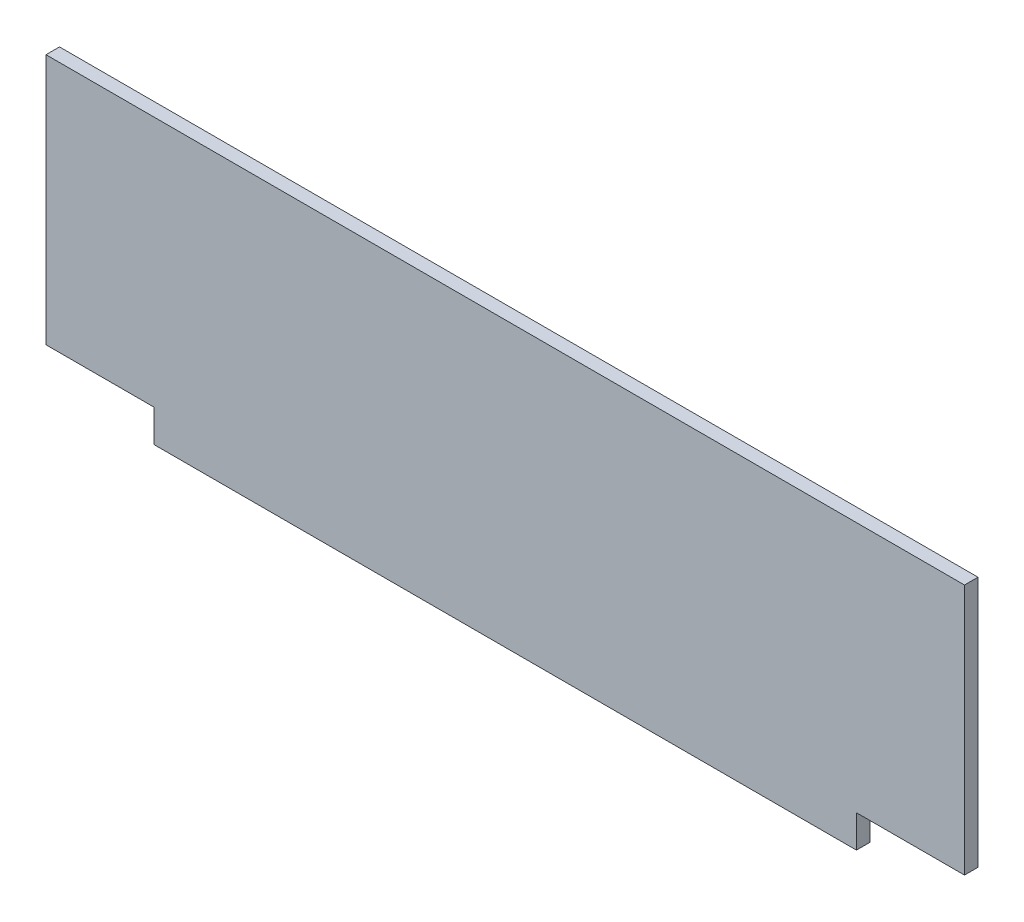
ISO-10303-21;
HEADER;
FILE_DESCRIPTION(('STEP AP214'),'2;1');
FILE_NAME('part.step','',(''),(''),'','','');
FILE_SCHEMA(('AUTOMOTIVE_DESIGN { 1 0 10303 214 1 1 1 1 }'));
ENDSEC;
DATA;
#1=APPLICATION_CONTEXT('core data for automotive mechanical design processes');
#2=APPLICATION_PROTOCOL_DEFINITION('international standard','automotive_design',2000,#1);
#3=PRODUCT_CONTEXT('',#1,'mechanical');
#4=PRODUCT('Part','Part','',(#3));
#5=PRODUCT_RELATED_PRODUCT_CATEGORY('part','',(#4));
#6=PRODUCT_DEFINITION_FORMATION('','',#4);
#7=PRODUCT_DEFINITION_CONTEXT('part definition',#1,'design');
#8=PRODUCT_DEFINITION('design','',#6,#7);
#9=PRODUCT_DEFINITION_SHAPE('','',#8);
#10=(LENGTH_UNIT() NAMED_UNIT(*) SI_UNIT(.MILLI.,.METRE.));
#11=(NAMED_UNIT(*) PLANE_ANGLE_UNIT() SI_UNIT($,.RADIAN.));
#12=(NAMED_UNIT(*) SI_UNIT($,.STERADIAN.) SOLID_ANGLE_UNIT());
#13=UNCERTAINTY_MEASURE_WITH_UNIT(LENGTH_MEASURE(1.E-05),#10,'distance_accuracy_value','');
#14=(GEOMETRIC_REPRESENTATION_CONTEXT(3) GLOBAL_UNCERTAINTY_ASSIGNED_CONTEXT((#13)) GLOBAL_UNIT_ASSIGNED_CONTEXT((#10,
#11,#12)) REPRESENTATION_CONTEXT('',''));
#15=CARTESIAN_POINT('',(0.,0.,0.));
#16=DIRECTION('',(0.,0.,1.));
#17=DIRECTION('',(1.,0.,0.));
#18=AXIS2_PLACEMENT_3D('',#15,#16,#17);
#19=CARTESIAN_POINT('',(-340.,105.,10.));
#20=DIRECTION('',(1.,0.,0.));
#21=DIRECTION('',(0.,0.,-1.));
#22=AXIS2_PLACEMENT_3D('',#19,#20,#21);
#23=PLANE('',#22);
#24=DIRECTION('',(0.,-1.,0.));
#25=VECTOR('',#24,1.);
#26=CARTESIAN_POINT('',(-340.,105.,0.));
#27=LINE('',#26,#25);
#28=CARTESIAN_POINT('',(-340.,105.,0.));
#29=VERTEX_POINT('',#28);
#30=CARTESIAN_POINT('',(-340.,-81.,0.));
#31=VERTEX_POINT('',#30);
#32=EDGE_CURVE('E123',#29,#31,#27,.T.);
#33=ORIENTED_EDGE('',*,*,#32,.T.);
#34=DIRECTION('',(0.,0.,1.));
#35=VECTOR('',#34,1.);
#36=CARTESIAN_POINT('',(-340.,-81.,0.));
#37=LINE('',#36,#35);
#38=CARTESIAN_POINT('',(-340.,-81.,10.));
#39=VERTEX_POINT('',#38);
#40=EDGE_CURVE('E139',#31,#39,#37,.T.);
#41=ORIENTED_EDGE('',*,*,#40,.T.);
#42=DIRECTION('',(0.,-1.,0.));
#43=VECTOR('',#42,1.);
#44=CARTESIAN_POINT('',(-340.,105.,10.));
#45=LINE('',#44,#43);
#46=CARTESIAN_POINT('',(-340.,105.,10.));
#47=VERTEX_POINT('',#46);
#48=EDGE_CURVE('E120',#47,#39,#45,.T.);
#49=ORIENTED_EDGE('',*,*,#48,.F.);
#50=DIRECTION('',(0.,0.,-1.));
#51=VECTOR('',#50,1.);
#52=CARTESIAN_POINT('',(-340.,105.,10.));
#53=LINE('',#52,#51);
#54=EDGE_CURVE('E40',#47,#29,#53,.T.);
#55=ORIENTED_EDGE('',*,*,#54,.T.);
#56=EDGE_LOOP('',(#33,#41,#49,#55));
#57=FACE_BOUND('',#56,.T.);
#58=ADVANCED_FACE('F33',(#57),#23,.F.);
#59=CARTESIAN_POINT('',(-340.,-105.,10.));
#60=DIRECTION('',(0.,1.,0.));
#61=DIRECTION('',(0.,0.,1.));
#62=AXIS2_PLACEMENT_3D('',#59,#60,#61);
#63=PLANE('',#62);
#64=DIRECTION('',(1.,0.,0.));
#65=VECTOR('',#64,1.);
#66=CARTESIAN_POINT('',(-340.,-105.,0.));
#67=LINE('',#66,#65);
#68=CARTESIAN_POINT('',(-260.,-105.,0.));
#69=VERTEX_POINT('',#68);
#70=CARTESIAN_POINT('',(260.,-105.,0.));
#71=VERTEX_POINT('',#70);
#72=EDGE_CURVE('E118',#69,#71,#67,.T.);
#73=ORIENTED_EDGE('',*,*,#72,.T.);
#74=DIRECTION('',(0.,0.,1.));
#75=VECTOR('',#74,1.);
#76=CARTESIAN_POINT('',(260.,-105.,0.));
#77=LINE('',#76,#75);
#78=CARTESIAN_POINT('',(260.,-105.,10.));
#79=VERTEX_POINT('',#78);
#80=EDGE_CURVE('E163',#71,#79,#77,.T.);
#81=ORIENTED_EDGE('',*,*,#80,.T.);
#82=DIRECTION('',(1.,0.,0.));
#83=VECTOR('',#82,1.);
#84=CARTESIAN_POINT('',(-340.,-105.,10.));
#85=LINE('',#84,#83);
#86=CARTESIAN_POINT('',(-260.,-105.,10.));
#87=VERTEX_POINT('',#86);
#88=EDGE_CURVE('E136',#87,#79,#85,.T.);
#89=ORIENTED_EDGE('',*,*,#88,.F.);
#90=DIRECTION('',(0.,0.,1.));
#91=VECTOR('',#90,1.);
#92=CARTESIAN_POINT('',(-260.,-105.,0.));
#93=LINE('',#92,#91);
#94=EDGE_CURVE('E143',#69,#87,#93,.T.);
#95=ORIENTED_EDGE('',*,*,#94,.F.);
#96=EDGE_LOOP('',(#73,#81,#89,#95));
#97=FACE_BOUND('',#96,.T.);
#98=ADVANCED_FACE('F161',(#97),#63,.F.);
#99=CARTESIAN_POINT('',(340.,105.,10.));
#100=DIRECTION('',(-1.,0.,0.));
#101=DIRECTION('',(0.,0.,1.));
#102=AXIS2_PLACEMENT_3D('',#99,#100,#101);
#103=PLANE('',#102);
#104=DIRECTION('',(0.,1.,0.));
#105=VECTOR('',#104,1.);
#106=CARTESIAN_POINT('',(340.,105.,10.));
#107=LINE('',#106,#105);
#108=CARTESIAN_POINT('',(340.,-81.,10.));
#109=VERTEX_POINT('',#108);
#110=CARTESIAN_POINT('',(340.,105.,10.));
#111=VERTEX_POINT('',#110);
#112=EDGE_CURVE('E112',#109,#111,#107,.T.);
#113=ORIENTED_EDGE('',*,*,#112,.F.);
#114=DIRECTION('',(0.,0.,1.));
#115=VECTOR('',#114,1.);
#116=CARTESIAN_POINT('',(340.,-81.,0.));
#117=LINE('',#116,#115);
#118=CARTESIAN_POINT('',(340.,-81.,0.));
#119=VERTEX_POINT('',#118);
#120=EDGE_CURVE('E100',#119,#109,#117,.T.);
#121=ORIENTED_EDGE('',*,*,#120,.F.);
#122=DIRECTION('',(0.,1.,0.));
#123=VECTOR('',#122,1.);
#124=CARTESIAN_POINT('',(340.,105.,0.));
#125=LINE('',#124,#123);
#126=CARTESIAN_POINT('',(340.,105.,0.));
#127=VERTEX_POINT('',#126);
#128=EDGE_CURVE('E111',#119,#127,#125,.T.);
#129=ORIENTED_EDGE('',*,*,#128,.T.);
#130=DIRECTION('',(0.,0.,-1.));
#131=VECTOR('',#130,1.);
#132=CARTESIAN_POINT('',(340.,105.,10.));
#133=LINE('',#132,#131);
#134=EDGE_CURVE('E11',#111,#127,#133,.T.);
#135=ORIENTED_EDGE('',*,*,#134,.F.);
#136=EDGE_LOOP('',(#113,#121,#129,#135));
#137=FACE_BOUND('',#136,.T.);
#138=ADVANCED_FACE('F109',(#137),#103,.F.);
#139=CARTESIAN_POINT('',(-340.,105.,10.));
#140=DIRECTION('',(0.,-1.,0.));
#141=DIRECTION('',(0.,0.,-1.));
#142=AXIS2_PLACEMENT_3D('',#139,#140,#141);
#143=PLANE('',#142);
#144=DIRECTION('',(-1.,0.,0.));
#145=VECTOR('',#144,1.);
#146=CARTESIAN_POINT('',(-340.,105.,0.));
#147=LINE('',#146,#145);
#148=EDGE_CURVE('E117',#127,#29,#147,.T.);
#149=ORIENTED_EDGE('',*,*,#148,.T.);
#150=ORIENTED_EDGE('',*,*,#54,.F.);
#151=DIRECTION('',(-1.,0.,0.));
#152=VECTOR('',#151,1.);
#153=CARTESIAN_POINT('',(-340.,105.,10.));
#154=LINE('',#153,#152);
#155=EDGE_CURVE('E127',#111,#47,#154,.T.);
#156=ORIENTED_EDGE('',*,*,#155,.F.);
#157=ORIENTED_EDGE('',*,*,#134,.T.);
#158=EDGE_LOOP('',(#149,#150,#156,#157));
#159=FACE_BOUND('',#158,.T.);
#160=ADVANCED_FACE('F183',(#159),#143,.F.);
#161=CARTESIAN_POINT('',(0.,0.,10.));
#162=DIRECTION('',(0.,0.,1.));
#163=DIRECTION('',(1.,0.,0.));
#164=AXIS2_PLACEMENT_3D('',#161,#162,#163);
#165=PLANE('',#164);
#166=DIRECTION('',(0.,-1.,0.));
#167=VECTOR('',#166,1.);
#168=CARTESIAN_POINT('',(260.,-105.,10.));
#169=LINE('',#168,#167);
#170=CARTESIAN_POINT('',(260.,-81.,10.));
#171=VERTEX_POINT('',#170);
#172=EDGE_CURVE('E105',#171,#79,#169,.T.);
#173=ORIENTED_EDGE('',*,*,#172,.F.);
#174=DIRECTION('',(-1.,0.,0.));
#175=VECTOR('',#174,1.);
#176=CARTESIAN_POINT('',(340.,-81.,10.));
#177=LINE('',#176,#175);
#178=EDGE_CURVE('E203',#109,#171,#177,.T.);
#179=ORIENTED_EDGE('',*,*,#178,.F.);
#180=ORIENTED_EDGE('',*,*,#112,.T.);
#181=ORIENTED_EDGE('',*,*,#155,.T.);
#182=ORIENTED_EDGE('',*,*,#48,.T.);
#183=DIRECTION('',(-1.,0.,0.));
#184=VECTOR('',#183,1.);
#185=CARTESIAN_POINT('',(-340.,-81.,10.));
#186=LINE('',#185,#184);
#187=CARTESIAN_POINT('',(-260.,-81.,10.));
#188=VERTEX_POINT('',#187);
#189=EDGE_CURVE('E146',#188,#39,#186,.T.);
#190=ORIENTED_EDGE('',*,*,#189,.F.);
#191=DIRECTION('',(0.,1.,0.));
#192=VECTOR('',#191,1.);
#193=CARTESIAN_POINT('',(-260.,-105.,10.));
#194=LINE('',#193,#192);
#195=EDGE_CURVE('E157',#87,#188,#194,.T.);
#196=ORIENTED_EDGE('',*,*,#195,.F.);
#197=ORIENTED_EDGE('',*,*,#88,.T.);
#198=EDGE_LOOP('',(#173,#179,#180,#181,#182,#190,#196,#197));
#199=FACE_BOUND('',#198,.T.);
#200=ADVANCED_FACE('F154',(#199),#165,.T.);
#201=CARTESIAN_POINT('',(0.,0.,0.));
#202=DIRECTION('',(0.,0.,1.));
#203=DIRECTION('',(1.,0.,0.));
#204=AXIS2_PLACEMENT_3D('',#201,#202,#203);
#205=PLANE('',#204);
#206=DIRECTION('',(-1.,0.,0.));
#207=VECTOR('',#206,1.);
#208=CARTESIAN_POINT('',(340.,-81.,0.));
#209=LINE('',#208,#207);
#210=CARTESIAN_POINT('',(260.,-81.,0.));
#211=VERTEX_POINT('',#210);
#212=EDGE_CURVE('E96',#119,#211,#209,.T.);
#213=ORIENTED_EDGE('',*,*,#212,.T.);
#214=DIRECTION('',(0.,-1.,0.));
#215=VECTOR('',#214,1.);
#216=CARTESIAN_POINT('',(260.,-105.,0.));
#217=LINE('',#216,#215);
#218=EDGE_CURVE('E47',#211,#71,#217,.T.);
#219=ORIENTED_EDGE('',*,*,#218,.T.);
#220=ORIENTED_EDGE('',*,*,#72,.F.);
#221=DIRECTION('',(0.,1.,0.));
#222=VECTOR('',#221,1.);
#223=CARTESIAN_POINT('',(-260.,-105.,0.));
#224=LINE('',#223,#222);
#225=CARTESIAN_POINT('',(-260.,-81.,0.));
#226=VERTEX_POINT('',#225);
#227=EDGE_CURVE('E169',#69,#226,#224,.T.);
#228=ORIENTED_EDGE('',*,*,#227,.T.);
#229=DIRECTION('',(-1.,0.,0.));
#230=VECTOR('',#229,1.);
#231=CARTESIAN_POINT('',(-340.,-81.,0.));
#232=LINE('',#231,#230);
#233=EDGE_CURVE('E55',#226,#31,#232,.T.);
#234=ORIENTED_EDGE('',*,*,#233,.T.);
#235=ORIENTED_EDGE('',*,*,#32,.F.);
#236=ORIENTED_EDGE('',*,*,#148,.F.);
#237=ORIENTED_EDGE('',*,*,#128,.F.);
#238=EDGE_LOOP('',(#213,#219,#220,#228,#234,#235,#236,#237));
#239=FACE_BOUND('',#238,.T.);
#240=ADVANCED_FACE('F115',(#239),#205,.F.);
#241=CARTESIAN_POINT('',(-340.,-81.,0.));
#242=DIRECTION('',(0.,1.,0.));
#243=DIRECTION('',(0.,0.,1.));
#244=AXIS2_PLACEMENT_3D('',#241,#242,#243);
#245=PLANE('',#244);
#246=ORIENTED_EDGE('',*,*,#189,.T.);
#247=ORIENTED_EDGE('',*,*,#40,.F.);
#248=ORIENTED_EDGE('',*,*,#233,.F.);
#249=DIRECTION('',(0.,0.,1.));
#250=VECTOR('',#249,1.);
#251=CARTESIAN_POINT('',(-260.,-81.,0.));
#252=LINE('',#251,#250);
#253=EDGE_CURVE('E141',#226,#188,#252,.T.);
#254=ORIENTED_EDGE('',*,*,#253,.T.);
#255=EDGE_LOOP('',(#246,#247,#248,#254));
#256=FACE_BOUND('',#255,.T.);
#257=ADVANCED_FACE('F174',(#256),#245,.F.);
#258=CARTESIAN_POINT('',(-260.,-105.,0.));
#259=DIRECTION('',(1.,0.,0.));
#260=DIRECTION('',(0.,0.,-1.));
#261=AXIS2_PLACEMENT_3D('',#258,#259,#260);
#262=PLANE('',#261);
#263=ORIENTED_EDGE('',*,*,#195,.T.);
#264=ORIENTED_EDGE('',*,*,#253,.F.);
#265=ORIENTED_EDGE('',*,*,#227,.F.);
#266=ORIENTED_EDGE('',*,*,#94,.T.);
#267=EDGE_LOOP('',(#263,#264,#265,#266));
#268=FACE_BOUND('',#267,.T.);
#269=ADVANCED_FACE('F173',(#268),#262,.F.);
#270=CARTESIAN_POINT('',(260.,-105.,0.));
#271=DIRECTION('',(-1.,0.,0.));
#272=DIRECTION('',(0.,0.,1.));
#273=AXIS2_PLACEMENT_3D('',#270,#271,#272);
#274=PLANE('',#273);
#275=ORIENTED_EDGE('',*,*,#172,.T.);
#276=ORIENTED_EDGE('',*,*,#80,.F.);
#277=ORIENTED_EDGE('',*,*,#218,.F.);
#278=DIRECTION('',(0.,0.,1.));
#279=VECTOR('',#278,1.);
#280=CARTESIAN_POINT('',(260.,-81.,0.));
#281=LINE('',#280,#279);
#282=EDGE_CURVE('E102',#211,#171,#281,.T.);
#283=ORIENTED_EDGE('',*,*,#282,.T.);
#284=EDGE_LOOP('',(#275,#276,#277,#283));
#285=FACE_BOUND('',#284,.T.);
#286=ADVANCED_FACE('F195',(#285),#274,.F.);
#287=CARTESIAN_POINT('',(340.,-81.,0.));
#288=DIRECTION('',(0.,1.,0.));
#289=DIRECTION('',(-1.,0.,0.));
#290=AXIS2_PLACEMENT_3D('',#287,#288,#289);
#291=PLANE('',#290);
#292=ORIENTED_EDGE('',*,*,#178,.T.);
#293=ORIENTED_EDGE('',*,*,#282,.F.);
#294=ORIENTED_EDGE('',*,*,#212,.F.);
#295=ORIENTED_EDGE('',*,*,#120,.T.);
#296=EDGE_LOOP('',(#292,#293,#294,#295));
#297=FACE_BOUND('',#296,.T.);
#298=ADVANCED_FACE('F99',(#297),#291,.F.);
#299=CLOSED_SHELL('',(#58,#98,#138,#160,#200,#240,#257,#269,#286,#298));
#300=MANIFOLD_SOLID_BREP('B2',#299);
#301=ADVANCED_BREP_SHAPE_REPRESENTATION('',(#18,#300),#14);
#302=SHAPE_DEFINITION_REPRESENTATION(#9,#301);
ENDSEC;
END-ISO-10303-21;
